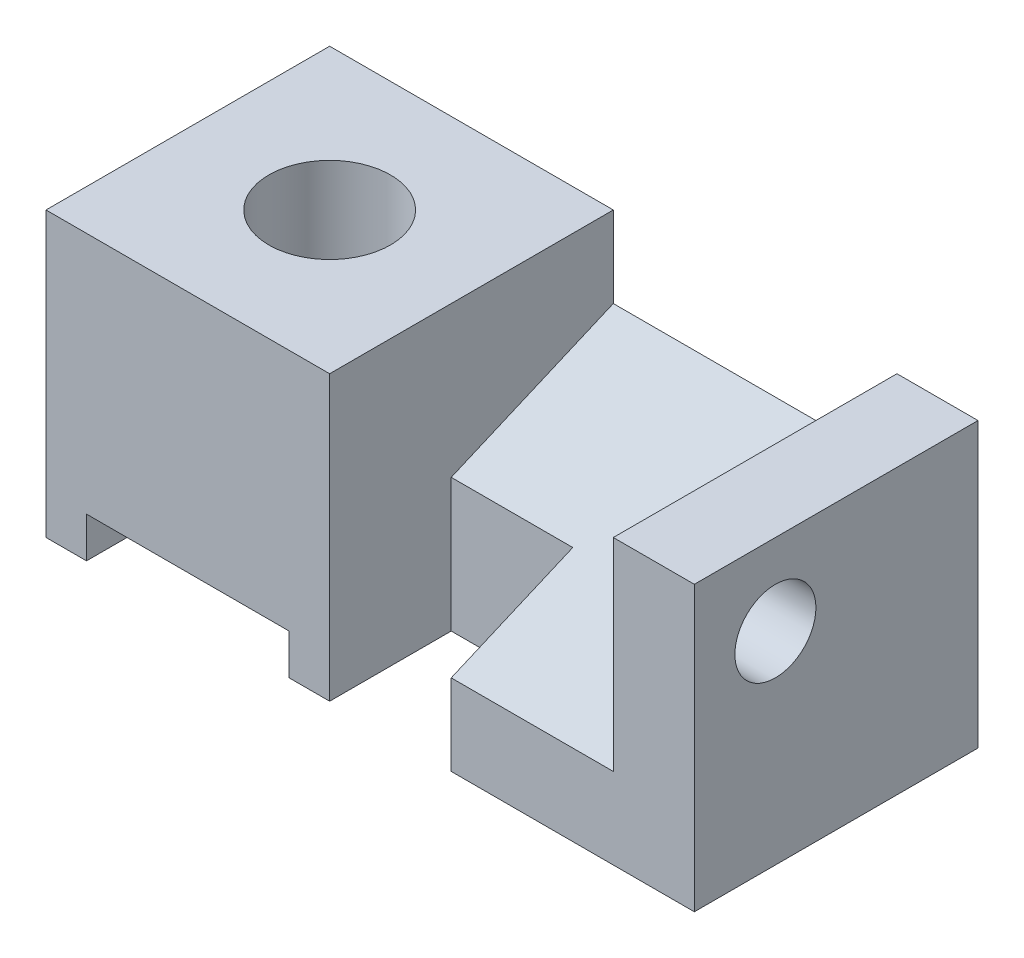
ISO-10303-21;
HEADER;
FILE_DESCRIPTION(('STEP AP214'),'2;1');
FILE_NAME('part.step','',(''),(''),'','','');
FILE_SCHEMA(('AUTOMOTIVE_DESIGN { 1 0 10303 214 1 1 1 1 }'));
ENDSEC;
DATA;
#1=APPLICATION_CONTEXT('core data for automotive mechanical design processes');
#2=APPLICATION_PROTOCOL_DEFINITION('international standard','automotive_design',2000,#1);
#3=PRODUCT_CONTEXT('',#1,'mechanical');
#4=PRODUCT('Part','Part','',(#3));
#5=PRODUCT_RELATED_PRODUCT_CATEGORY('part','',(#4));
#6=PRODUCT_DEFINITION_FORMATION('','',#4);
#7=PRODUCT_DEFINITION_CONTEXT('part definition',#1,'design');
#8=PRODUCT_DEFINITION('design','',#6,#7);
#9=PRODUCT_DEFINITION_SHAPE('','',#8);
#10=(LENGTH_UNIT() NAMED_UNIT(*) SI_UNIT(.MILLI.,.METRE.));
#11=(NAMED_UNIT(*) PLANE_ANGLE_UNIT() SI_UNIT($,.RADIAN.));
#12=(NAMED_UNIT(*) SI_UNIT($,.STERADIAN.) SOLID_ANGLE_UNIT());
#13=UNCERTAINTY_MEASURE_WITH_UNIT(LENGTH_MEASURE(1.E-05),#10,'distance_accuracy_value','');
#14=(GEOMETRIC_REPRESENTATION_CONTEXT(3) GLOBAL_UNCERTAINTY_ASSIGNED_CONTEXT((#13)) GLOBAL_UNIT_ASSIGNED_CONTEXT((#10,
#11,#12)) REPRESENTATION_CONTEXT('',''));
#15=CARTESIAN_POINT('',(0.,0.,0.));
#16=DIRECTION('',(0.,0.,1.));
#17=DIRECTION('',(1.,0.,0.));
#18=AXIS2_PLACEMENT_3D('',#15,#16,#17);
#19=CARTESIAN_POINT('',(0.,0.,0.));
#20=DIRECTION('',(0.,-1.,0.));
#21=DIRECTION('',(0.,0.,-1.));
#22=AXIS2_PLACEMENT_3D('',#19,#20,#21);
#23=PLANE('',#22);
#24=DIRECTION('',(0.,0.,1.));
#25=VECTOR('',#24,1.);
#26=CARTESIAN_POINT('',(5.,0.,-35.));
#27=LINE('',#26,#25);
#28=CARTESIAN_POINT('',(5.,0.,-35.));
#29=VERTEX_POINT('',#28);
#30=CARTESIAN_POINT('',(5.,0.,0.));
#31=VERTEX_POINT('',#30);
#32=EDGE_CURVE('E147',#29,#31,#27,.T.);
#33=ORIENTED_EDGE('',*,*,#32,.T.);
#34=DIRECTION('',(1.,0.,0.));
#35=VECTOR('',#34,1.);
#36=CARTESIAN_POINT('',(0.,0.,0.));
#37=LINE('',#36,#35);
#38=CARTESIAN_POINT('',(0.,0.,0.));
#39=VERTEX_POINT('',#38);
#40=EDGE_CURVE('E182',#39,#31,#37,.T.);
#41=ORIENTED_EDGE('',*,*,#40,.F.);
#42=DIRECTION('',(0.,0.,1.));
#43=VECTOR('',#42,1.);
#44=CARTESIAN_POINT('',(0.,0.,0.));
#45=LINE('',#44,#43);
#46=CARTESIAN_POINT('',(0.,0.,-35.));
#47=VERTEX_POINT('',#46);
#48=EDGE_CURVE('E172',#47,#39,#45,.T.);
#49=ORIENTED_EDGE('',*,*,#48,.F.);
#50=DIRECTION('',(-1.,0.,0.));
#51=VECTOR('',#50,1.);
#52=CARTESIAN_POINT('',(0.,0.,-35.));
#53=LINE('',#52,#51);
#54=EDGE_CURVE('E164',#29,#47,#53,.T.);
#55=ORIENTED_EDGE('',*,*,#54,.F.);
#56=EDGE_LOOP('',(#33,#41,#49,#55));
#57=FACE_BOUND('',#56,.T.);
#58=ADVANCED_FACE('F39',(#57),#23,.T.);
#59=CARTESIAN_POINT('',(0.,35.,0.));
#60=DIRECTION('',(0.,0.,-1.));
#61=DIRECTION('',(-1.,0.,0.));
#62=AXIS2_PLACEMENT_3D('',#59,#60,#61);
#63=PLANE('',#62);
#64=ORIENTED_EDGE('',*,*,#40,.T.);
#65=DIRECTION('',(0.,-1.,0.));
#66=VECTOR('',#65,1.);
#67=CARTESIAN_POINT('',(5.,0.,0.));
#68=LINE('',#67,#66);
#69=CARTESIAN_POINT('',(5.,5.,0.));
#70=VERTEX_POINT('',#69);
#71=EDGE_CURVE('E153',#70,#31,#68,.T.);
#72=ORIENTED_EDGE('',*,*,#71,.F.);
#73=DIRECTION('',(-1.,0.,0.));
#74=VECTOR('',#73,1.);
#75=CARTESIAN_POINT('',(5.,5.,0.));
#76=LINE('',#75,#74);
#77=CARTESIAN_POINT('',(30.,5.,0.));
#78=VERTEX_POINT('',#77);
#79=EDGE_CURVE('E168',#78,#70,#76,.T.);
#80=ORIENTED_EDGE('',*,*,#79,.F.);
#81=DIRECTION('',(0.,1.,0.));
#82=VECTOR('',#81,1.);
#83=CARTESIAN_POINT('',(30.,0.,0.));
#84=LINE('',#83,#82);
#85=CARTESIAN_POINT('',(30.,0.,0.));
#86=VERTEX_POINT('',#85);
#87=EDGE_CURVE('E330',#86,#78,#84,.T.);
#88=ORIENTED_EDGE('',*,*,#87,.F.);
#89=CARTESIAN_POINT('',(35.,0.,0.));
#90=VERTEX_POINT('',#89);
#91=EDGE_CURVE('E231',#86,#90,#37,.T.);
#92=ORIENTED_EDGE('',*,*,#91,.T.);
#93=DIRECTION('',(0.,-1.,0.));
#94=VECTOR('',#93,1.);
#95=CARTESIAN_POINT('',(35.,10.,0.));
#96=LINE('',#95,#94);
#97=CARTESIAN_POINT('',(35.,35.,0.));
#98=VERTEX_POINT('',#97);
#99=EDGE_CURVE('E269',#98,#90,#96,.T.);
#100=ORIENTED_EDGE('',*,*,#99,.F.);
#101=DIRECTION('',(1.,0.,0.));
#102=VECTOR('',#101,1.);
#103=CARTESIAN_POINT('',(0.,35.,0.));
#104=LINE('',#103,#102);
#105=CARTESIAN_POINT('',(0.,35.,0.));
#106=VERTEX_POINT('',#105);
#107=EDGE_CURVE('E243',#106,#98,#104,.T.);
#108=ORIENTED_EDGE('',*,*,#107,.F.);
#109=DIRECTION('',(0.,-1.,0.));
#110=VECTOR('',#109,1.);
#111=CARTESIAN_POINT('',(0.,35.,0.));
#112=LINE('',#111,#110);
#113=EDGE_CURVE('E197',#106,#39,#112,.T.);
#114=ORIENTED_EDGE('',*,*,#113,.T.);
#115=EDGE_LOOP('',(#64,#72,#80,#88,#92,#100,#108,#114));
#116=FACE_BOUND('',#115,.T.);
#117=ADVANCED_FACE('F238',(#116),#63,.F.);
#118=CARTESIAN_POINT('',(35.,25.,-35.));
#119=DIRECTION('',(0.,-0.919145030018058,-0.393919298579168));
#120=DIRECTION('',(0.,0.393919298579168,-0.919145030018058));
#121=AXIS2_PLACEMENT_3D('',#118,#119,#120);
#122=PLANE('',#121);
#123=DIRECTION('',(1.,0.,0.));
#124=VECTOR('',#123,1.);
#125=CARTESIAN_POINT('',(35.,16.4285714285714,-15.));
#126=LINE('',#125,#124);
#127=CARTESIAN_POINT('',(35.,16.4285714285714,-15.));
#128=VERTEX_POINT('',#127);
#129=CARTESIAN_POINT('',(50.,16.4285714285714,-15.));
#130=VERTEX_POINT('',#129);
#131=EDGE_CURVE('E301',#128,#130,#126,.T.);
#132=ORIENTED_EDGE('',*,*,#131,.T.);
#133=DIRECTION('',(0.,-0.393919298579168,0.919145030018058));
#134=VECTOR('',#133,1.);
#135=CARTESIAN_POINT('',(50.,25.,-35.));
#136=LINE('',#135,#134);
#137=CARTESIAN_POINT('',(50.,10.,0.));
#138=VERTEX_POINT('',#137);
#139=EDGE_CURVE('E290',#130,#138,#136,.T.);
#140=ORIENTED_EDGE('',*,*,#139,.T.);
#141=DIRECTION('',(1.,0.,0.));
#142=VECTOR('',#141,1.);
#143=CARTESIAN_POINT('',(35.,10.,0.));
#144=LINE('',#143,#142);
#145=CARTESIAN_POINT('',(70.,10.,0.));
#146=VERTEX_POINT('',#145);
#147=EDGE_CURVE('E223',#138,#146,#144,.T.);
#148=ORIENTED_EDGE('',*,*,#147,.T.);
#149=DIRECTION('',(0.,-0.393919298579168,0.919145030018058));
#150=VECTOR('',#149,1.);
#151=CARTESIAN_POINT('',(70.,25.,-35.));
#152=LINE('',#151,#150);
#153=CARTESIAN_POINT('',(70.,25.,-35.));
#154=VERTEX_POINT('',#153);
#155=EDGE_CURVE('E201',#154,#146,#152,.T.);
#156=ORIENTED_EDGE('',*,*,#155,.F.);
#157=DIRECTION('',(1.,0.,0.));
#158=VECTOR('',#157,1.);
#159=CARTESIAN_POINT('',(35.,25.,-35.));
#160=LINE('',#159,#158);
#161=CARTESIAN_POINT('',(35.,25.,-35.));
#162=VERTEX_POINT('',#161);
#163=EDGE_CURVE('E234',#162,#154,#160,.T.);
#164=ORIENTED_EDGE('',*,*,#163,.F.);
#165=DIRECTION('',(0.,0.393919298579168,-0.919145030018058));
#166=VECTOR('',#165,1.);
#167=CARTESIAN_POINT('',(35.,25.,-35.));
#168=LINE('',#167,#166);
#169=EDGE_CURVE('E266',#128,#162,#168,.T.);
#170=ORIENTED_EDGE('',*,*,#169,.F.);
#171=EDGE_LOOP('',(#132,#140,#148,#156,#164,#170));
#172=FACE_BOUND('',#171,.T.);
#173=ADVANCED_FACE('F366',(#172),#122,.F.);
#174=CARTESIAN_POINT('',(0.,35.,0.));
#175=DIRECTION('',(1.,0.,0.));
#176=DIRECTION('',(0.,0.,-1.));
#177=AXIS2_PLACEMENT_3D('',#174,#175,#176);
#178=PLANE('',#177);
#179=ORIENTED_EDGE('',*,*,#48,.T.);
#180=ORIENTED_EDGE('',*,*,#113,.F.);
#181=DIRECTION('',(0.,0.,1.));
#182=VECTOR('',#181,1.);
#183=CARTESIAN_POINT('',(0.,35.,0.));
#184=LINE('',#183,#182);
#185=CARTESIAN_POINT('',(0.,35.,-35.));
#186=VERTEX_POINT('',#185);
#187=EDGE_CURVE('E180',#186,#106,#184,.T.);
#188=ORIENTED_EDGE('',*,*,#187,.F.);
#189=DIRECTION('',(0.,-1.,0.));
#190=VECTOR('',#189,1.);
#191=CARTESIAN_POINT('',(0.,35.,-35.));
#192=LINE('',#191,#190);
#193=EDGE_CURVE('E186',#186,#47,#192,.T.);
#194=ORIENTED_EDGE('',*,*,#193,.T.);
#195=EDGE_LOOP('',(#179,#180,#188,#194));
#196=FACE_BOUND('',#195,.T.);
#197=ADVANCED_FACE('F41',(#196),#178,.F.);
#198=ORIENTED_EDGE('',*,*,#147,.F.);
#199=DIRECTION('',(0.,-1.,0.));
#200=VECTOR('',#199,1.);
#201=CARTESIAN_POINT('',(50.,35.,0.));
#202=LINE('',#201,#200);
#203=CARTESIAN_POINT('',(50.,0.,0.));
#204=VERTEX_POINT('',#203);
#205=EDGE_CURVE('E211',#138,#204,#202,.T.);
#206=ORIENTED_EDGE('',*,*,#205,.T.);
#207=CARTESIAN_POINT('',(80.,0.,0.));
#208=VERTEX_POINT('',#207);
#209=EDGE_CURVE('E221',#204,#208,#37,.T.);
#210=ORIENTED_EDGE('',*,*,#209,.T.);
#211=DIRECTION('',(0.,-1.,0.));
#212=VECTOR('',#211,1.);
#213=CARTESIAN_POINT('',(80.,35.,0.));
#214=LINE('',#213,#212);
#215=CARTESIAN_POINT('',(80.,35.,0.));
#216=VERTEX_POINT('',#215);
#217=EDGE_CURVE('E193',#216,#208,#214,.T.);
#218=ORIENTED_EDGE('',*,*,#217,.F.);
#219=DIRECTION('',(1.,0.,0.));
#220=VECTOR('',#219,1.);
#221=CARTESIAN_POINT('',(70.,35.,0.));
#222=LINE('',#221,#220);
#223=CARTESIAN_POINT('',(70.,35.,0.));
#224=VERTEX_POINT('',#223);
#225=EDGE_CURVE('E276',#224,#216,#222,.T.);
#226=ORIENTED_EDGE('',*,*,#225,.F.);
#227=DIRECTION('',(0.,-1.,0.));
#228=VECTOR('',#227,1.);
#229=CARTESIAN_POINT('',(70.,0.,0.));
#230=LINE('',#229,#228);
#231=EDGE_CURVE('E281',#224,#146,#230,.T.);
#232=ORIENTED_EDGE('',*,*,#231,.T.);
#233=EDGE_LOOP('',(#198,#206,#210,#218,#226,#232));
#234=FACE_BOUND('',#233,.T.);
#235=ADVANCED_FACE('F220',(#234),#63,.F.);
#236=CARTESIAN_POINT('',(80.,35.,0.));
#237=DIRECTION('',(-1.,0.,0.));
#238=DIRECTION('',(0.,0.,1.));
#239=AXIS2_PLACEMENT_3D('',#236,#237,#238);
#240=PLANE('',#239);
#241=CARTESIAN_POINT('',(80.,25.,-10.));
#242=DIRECTION('',(1.,0.,0.));
#243=DIRECTION('',(0.,0.,-1.));
#244=AXIS2_PLACEMENT_3D('',#241,#242,#243);
#245=CIRCLE('',#244,5.);
#246=CARTESIAN_POINT('',(80.,25.,-15.));
#247=VERTEX_POINT('',#246);
#248=EDGE_CURVE('E312',#247,#247,#245,.T.);
#249=ORIENTED_EDGE('',*,*,#248,.F.);
#250=EDGE_LOOP('',(#249));
#251=FACE_BOUND('',#250,.T.);
#252=DIRECTION('',(0.,-1.,0.));
#253=VECTOR('',#252,1.);
#254=CARTESIAN_POINT('',(80.,35.,-35.));
#255=LINE('',#254,#253);
#256=CARTESIAN_POINT('',(80.,35.,-35.));
#257=VERTEX_POINT('',#256);
#258=CARTESIAN_POINT('',(80.,0.,-35.));
#259=VERTEX_POINT('',#258);
#260=EDGE_CURVE('E189',#257,#259,#255,.T.);
#261=ORIENTED_EDGE('',*,*,#260,.F.);
#262=DIRECTION('',(0.,0.,1.));
#263=VECTOR('',#262,1.);
#264=CARTESIAN_POINT('',(80.,35.,-35.));
#265=LINE('',#264,#263);
#266=EDGE_CURVE('E285',#257,#216,#265,.T.);
#267=ORIENTED_EDGE('',*,*,#266,.T.);
#268=ORIENTED_EDGE('',*,*,#217,.T.);
#269=DIRECTION('',(0.,0.,-1.));
#270=VECTOR('',#269,1.);
#271=CARTESIAN_POINT('',(80.,0.,0.));
#272=LINE('',#271,#270);
#273=EDGE_CURVE('E175',#208,#259,#272,.T.);
#274=ORIENTED_EDGE('',*,*,#273,.T.);
#275=EDGE_LOOP('',(#261,#267,#268,#274));
#276=FACE_BOUND('',#275,.T.);
#277=ADVANCED_FACE('F383',(#251,#276),#240,.F.);
#278=CARTESIAN_POINT('',(0.,35.,-35.));
#279=DIRECTION('',(0.,0.,1.));
#280=DIRECTION('',(1.,0.,0.));
#281=AXIS2_PLACEMENT_3D('',#278,#279,#280);
#282=PLANE('',#281);
#283=DIRECTION('',(-1.,0.,0.));
#284=VECTOR('',#283,1.);
#285=CARTESIAN_POINT('',(5.,5.,-35.));
#286=LINE('',#285,#284);
#287=CARTESIAN_POINT('',(30.,5.,-35.));
#288=VERTEX_POINT('',#287);
#289=CARTESIAN_POINT('',(5.,5.,-35.));
#290=VERTEX_POINT('',#289);
#291=EDGE_CURVE('E159',#288,#290,#286,.T.);
#292=ORIENTED_EDGE('',*,*,#291,.T.);
#293=DIRECTION('',(0.,-1.,0.));
#294=VECTOR('',#293,1.);
#295=CARTESIAN_POINT('',(5.,0.,-35.));
#296=LINE('',#295,#294);
#297=EDGE_CURVE('E150',#290,#29,#296,.T.);
#298=ORIENTED_EDGE('',*,*,#297,.T.);
#299=ORIENTED_EDGE('',*,*,#54,.T.);
#300=ORIENTED_EDGE('',*,*,#193,.F.);
#301=DIRECTION('',(-1.,0.,0.));
#302=VECTOR('',#301,1.);
#303=CARTESIAN_POINT('',(0.,35.,-35.));
#304=LINE('',#303,#302);
#305=CARTESIAN_POINT('',(35.,35.,-35.));
#306=VERTEX_POINT('',#305);
#307=EDGE_CURVE('E190',#306,#186,#304,.T.);
#308=ORIENTED_EDGE('',*,*,#307,.F.);
#309=DIRECTION('',(0.,1.,0.));
#310=VECTOR('',#309,1.);
#311=CARTESIAN_POINT('',(35.,35.,-35.));
#312=LINE('',#311,#310);
#313=EDGE_CURVE('E250',#162,#306,#312,.T.);
#314=ORIENTED_EDGE('',*,*,#313,.F.);
#315=ORIENTED_EDGE('',*,*,#163,.T.);
#316=DIRECTION('',(0.,1.,0.));
#317=VECTOR('',#316,1.);
#318=CARTESIAN_POINT('',(70.,0.,-35.));
#319=LINE('',#318,#317);
#320=CARTESIAN_POINT('',(70.,35.,-35.));
#321=VERTEX_POINT('',#320);
#322=EDGE_CURVE('E289',#154,#321,#319,.T.);
#323=ORIENTED_EDGE('',*,*,#322,.T.);
#324=DIRECTION('',(1.,0.,0.));
#325=VECTOR('',#324,1.);
#326=CARTESIAN_POINT('',(70.,35.,-35.));
#327=LINE('',#326,#325);
#328=EDGE_CURVE('E277',#321,#257,#327,.T.);
#329=ORIENTED_EDGE('',*,*,#328,.T.);
#330=ORIENTED_EDGE('',*,*,#260,.T.);
#331=CARTESIAN_POINT('',(30.,0.,-35.));
#332=VERTEX_POINT('',#331);
#333=EDGE_CURVE('E174',#259,#332,#53,.T.);
#334=ORIENTED_EDGE('',*,*,#333,.T.);
#335=DIRECTION('',(0.,1.,0.));
#336=VECTOR('',#335,1.);
#337=CARTESIAN_POINT('',(30.,0.,-35.));
#338=LINE('',#337,#336);
#339=EDGE_CURVE('E56',#332,#288,#338,.T.);
#340=ORIENTED_EDGE('',*,*,#339,.T.);
#341=EDGE_LOOP('',(#292,#298,#299,#300,#308,#314,#315,#323,#329,#330,#334,#340));
#342=FACE_BOUND('',#341,.T.);
#343=ADVANCED_FACE('F162',(#342),#282,.F.);
#344=CARTESIAN_POINT('',(0.,35.,0.));
#345=DIRECTION('',(0.,-1.,0.));
#346=DIRECTION('',(0.,0.,-1.));
#347=AXIS2_PLACEMENT_3D('',#344,#345,#346);
#348=PLANE('',#347);
#349=CARTESIAN_POINT('',(17.5,35.,-17.5));
#350=DIRECTION('',(0.,1.,0.));
#351=DIRECTION('',(0.,0.,1.));
#352=AXIS2_PLACEMENT_3D('',#349,#350,#351);
#353=CIRCLE('',#352,7.5);
#354=CARTESIAN_POINT('',(17.5,35.,-10.));
#355=VERTEX_POINT('',#354);
#356=EDGE_CURVE('E340',#355,#355,#353,.T.);
#357=ORIENTED_EDGE('',*,*,#356,.F.);
#358=EDGE_LOOP('',(#357));
#359=FACE_BOUND('',#358,.T.);
#360=ORIENTED_EDGE('',*,*,#107,.T.);
#361=DIRECTION('',(0.,0.,1.));
#362=VECTOR('',#361,1.);
#363=CARTESIAN_POINT('',(35.,35.,0.));
#364=LINE('',#363,#362);
#365=EDGE_CURVE('E273',#306,#98,#364,.T.);
#366=ORIENTED_EDGE('',*,*,#365,.F.);
#367=ORIENTED_EDGE('',*,*,#307,.T.);
#368=ORIENTED_EDGE('',*,*,#187,.T.);
#369=EDGE_LOOP('',(#360,#366,#367,#368));
#370=FACE_BOUND('',#369,.T.);
#371=ADVANCED_FACE('F371',(#359,#370),#348,.F.);
#372=DIRECTION('',(0.,0.,1.));
#373=VECTOR('',#372,1.);
#374=CARTESIAN_POINT('',(30.,0.,-35.));
#375=LINE('',#374,#373);
#376=EDGE_CURVE('E158',#332,#86,#375,.T.);
#377=ORIENTED_EDGE('',*,*,#376,.F.);
#378=ORIENTED_EDGE('',*,*,#333,.F.);
#379=ORIENTED_EDGE('',*,*,#273,.F.);
#380=ORIENTED_EDGE('',*,*,#209,.F.);
#381=DIRECTION('',(0.,0.,1.));
#382=VECTOR('',#381,1.);
#383=CARTESIAN_POINT('',(50.,0.,0.));
#384=LINE('',#383,#382);
#385=CARTESIAN_POINT('',(50.,0.,-15.));
#386=VERTEX_POINT('',#385);
#387=EDGE_CURVE('E49',#386,#204,#384,.T.);
#388=ORIENTED_EDGE('',*,*,#387,.F.);
#389=DIRECTION('',(1.,0.,0.));
#390=VECTOR('',#389,1.);
#391=CARTESIAN_POINT('',(0.,0.,-15.));
#392=LINE('',#391,#390);
#393=CARTESIAN_POINT('',(35.,0.,-15.));
#394=VERTEX_POINT('',#393);
#395=EDGE_CURVE('E225',#394,#386,#392,.T.);
#396=ORIENTED_EDGE('',*,*,#395,.F.);
#397=DIRECTION('',(0.,0.,-1.));
#398=VECTOR('',#397,1.);
#399=CARTESIAN_POINT('',(35.,0.,0.));
#400=LINE('',#399,#398);
#401=EDGE_CURVE('E11',#90,#394,#400,.T.);
#402=ORIENTED_EDGE('',*,*,#401,.F.);
#403=ORIENTED_EDGE('',*,*,#91,.F.);
#404=EDGE_LOOP('',(#377,#378,#379,#380,#388,#396,#402,#403));
#405=FACE_BOUND('',#404,.T.);
#406=ADVANCED_FACE('F228',(#405),#23,.T.);
#407=CARTESIAN_POINT('',(35.,0.,0.));
#408=DIRECTION('',(-1.,0.,0.));
#409=DIRECTION('',(0.,0.,1.));
#410=AXIS2_PLACEMENT_3D('',#407,#408,#409);
#411=PLANE('',#410);
#412=ORIENTED_EDGE('',*,*,#365,.T.);
#413=ORIENTED_EDGE('',*,*,#99,.T.);
#414=ORIENTED_EDGE('',*,*,#401,.T.);
#415=DIRECTION('',(0.,-1.,0.));
#416=VECTOR('',#415,1.);
#417=CARTESIAN_POINT('',(35.,35.,-15.));
#418=LINE('',#417,#416);
#419=EDGE_CURVE('E64',#128,#394,#418,.T.);
#420=ORIENTED_EDGE('',*,*,#419,.F.);
#421=ORIENTED_EDGE('',*,*,#169,.T.);
#422=ORIENTED_EDGE('',*,*,#313,.T.);
#423=EDGE_LOOP('',(#412,#413,#414,#420,#421,#422));
#424=FACE_BOUND('',#423,.T.);
#425=ADVANCED_FACE('F370',(#424),#411,.F.);
#426=CARTESIAN_POINT('',(70.,0.,0.));
#427=DIRECTION('',(1.,0.,0.));
#428=DIRECTION('',(0.,0.,-1.));
#429=AXIS2_PLACEMENT_3D('',#426,#427,#428);
#430=PLANE('',#429);
#431=CARTESIAN_POINT('',(70.,25.,-10.));
#432=DIRECTION('',(1.,0.,0.));
#433=DIRECTION('',(0.,0.,-1.));
#434=AXIS2_PLACEMENT_3D('',#431,#432,#433);
#435=CIRCLE('',#434,5.);
#436=CARTESIAN_POINT('',(70.,25.,-15.));
#437=VERTEX_POINT('',#436);
#438=EDGE_CURVE('E309',#437,#437,#435,.T.);
#439=ORIENTED_EDGE('',*,*,#438,.T.);
#440=EDGE_LOOP('',(#439));
#441=FACE_BOUND('',#440,.T.);
#442=ORIENTED_EDGE('',*,*,#322,.F.);
#443=ORIENTED_EDGE('',*,*,#155,.T.);
#444=ORIENTED_EDGE('',*,*,#231,.F.);
#445=DIRECTION('',(0.,0.,1.));
#446=VECTOR('',#445,1.);
#447=CARTESIAN_POINT('',(70.,35.,-35.));
#448=LINE('',#447,#446);
#449=EDGE_CURVE('E293',#321,#224,#448,.T.);
#450=ORIENTED_EDGE('',*,*,#449,.F.);
#451=EDGE_LOOP('',(#442,#443,#444,#450));
#452=FACE_BOUND('',#451,.T.);
#453=ADVANCED_FACE('F376',(#441,#452),#430,.F.);
#454=CARTESIAN_POINT('',(70.,35.,-35.));
#455=DIRECTION('',(0.,1.,0.));
#456=DIRECTION('',(0.,0.,1.));
#457=AXIS2_PLACEMENT_3D('',#454,#455,#456);
#458=PLANE('',#457);
#459=ORIENTED_EDGE('',*,*,#266,.F.);
#460=ORIENTED_EDGE('',*,*,#328,.F.);
#461=ORIENTED_EDGE('',*,*,#449,.T.);
#462=ORIENTED_EDGE('',*,*,#225,.T.);
#463=EDGE_LOOP('',(#459,#460,#461,#462));
#464=FACE_BOUND('',#463,.T.);
#465=ADVANCED_FACE('F388',(#464),#458,.T.);
#466=CARTESIAN_POINT('',(50.,35.,0.));
#467=DIRECTION('',(1.,0.,0.));
#468=DIRECTION('',(0.,0.,-1.));
#469=AXIS2_PLACEMENT_3D('',#466,#467,#468);
#470=PLANE('',#469);
#471=DIRECTION('',(0.,-1.,0.));
#472=VECTOR('',#471,1.);
#473=CARTESIAN_POINT('',(50.,35.,-15.));
#474=LINE('',#473,#472);
#475=EDGE_CURVE('E214',#130,#386,#474,.T.);
#476=ORIENTED_EDGE('',*,*,#475,.T.);
#477=ORIENTED_EDGE('',*,*,#387,.T.);
#478=ORIENTED_EDGE('',*,*,#205,.F.);
#479=ORIENTED_EDGE('',*,*,#139,.F.);
#480=EDGE_LOOP('',(#476,#477,#478,#479));
#481=FACE_BOUND('',#480,.T.);
#482=ADVANCED_FACE('F210',(#481),#470,.F.);
#483=CARTESIAN_POINT('',(35.,35.,-15.));
#484=DIRECTION('',(0.,0.,-1.));
#485=DIRECTION('',(-1.,0.,0.));
#486=AXIS2_PLACEMENT_3D('',#483,#484,#485);
#487=PLANE('',#486);
#488=ORIENTED_EDGE('',*,*,#419,.T.);
#489=ORIENTED_EDGE('',*,*,#395,.T.);
#490=ORIENTED_EDGE('',*,*,#475,.F.);
#491=ORIENTED_EDGE('',*,*,#131,.F.);
#492=EDGE_LOOP('',(#488,#489,#490,#491));
#493=FACE_BOUND('',#492,.T.);
#494=ADVANCED_FACE('F395',(#493),#487,.F.);
#495=CARTESIAN_POINT('',(70.,25.,-10.));
#496=DIRECTION('',(1.,0.,0.));
#497=DIRECTION('',(0.,0.,-1.));
#498=AXIS2_PLACEMENT_3D('',#495,#496,#497);
#499=CYLINDRICAL_SURFACE('',#498,5.);
#500=ORIENTED_EDGE('',*,*,#438,.F.);
#501=EDGE_LOOP('',(#500));
#502=FACE_BOUND('',#501,.T.);
#503=ORIENTED_EDGE('',*,*,#248,.T.);
#504=EDGE_LOOP('',(#503));
#505=FACE_BOUND('',#504,.T.);
#506=ADVANCED_FACE('F398',(#502,#505),#499,.F.);
#507=CARTESIAN_POINT('',(5.,0.,-35.));
#508=DIRECTION('',(-1.,0.,0.));
#509=DIRECTION('',(0.,0.,1.));
#510=AXIS2_PLACEMENT_3D('',#507,#508,#509);
#511=PLANE('',#510);
#512=ORIENTED_EDGE('',*,*,#71,.T.);
#513=ORIENTED_EDGE('',*,*,#32,.F.);
#514=ORIENTED_EDGE('',*,*,#297,.F.);
#515=DIRECTION('',(0.,0.,1.));
#516=VECTOR('',#515,1.);
#517=CARTESIAN_POINT('',(5.,5.,-35.));
#518=LINE('',#517,#516);
#519=EDGE_CURVE('E316',#290,#70,#518,.T.);
#520=ORIENTED_EDGE('',*,*,#519,.T.);
#521=EDGE_LOOP('',(#512,#513,#514,#520));
#522=FACE_BOUND('',#521,.T.);
#523=ADVANCED_FACE('F149',(#522),#511,.F.);
#524=CARTESIAN_POINT('',(5.,5.,-35.));
#525=DIRECTION('',(0.,1.,0.));
#526=DIRECTION('',(0.,0.,1.));
#527=AXIS2_PLACEMENT_3D('',#524,#525,#526);
#528=PLANE('',#527);
#529=CARTESIAN_POINT('',(17.5,5.,-17.5));
#530=DIRECTION('',(0.,1.,0.));
#531=DIRECTION('',(0.,0.,1.));
#532=AXIS2_PLACEMENT_3D('',#529,#530,#531);
#533=CIRCLE('',#532,7.5);
#534=CARTESIAN_POINT('',(17.5,5.,-10.));
#535=VERTEX_POINT('',#534);
#536=EDGE_CURVE('E43',#535,#535,#533,.T.);
#537=ORIENTED_EDGE('',*,*,#536,.T.);
#538=EDGE_LOOP('',(#537));
#539=FACE_BOUND('',#538,.T.);
#540=ORIENTED_EDGE('',*,*,#79,.T.);
#541=ORIENTED_EDGE('',*,*,#519,.F.);
#542=ORIENTED_EDGE('',*,*,#291,.F.);
#543=DIRECTION('',(0.,0.,1.));
#544=VECTOR('',#543,1.);
#545=CARTESIAN_POINT('',(30.,5.,-35.));
#546=LINE('',#545,#544);
#547=EDGE_CURVE('E322',#288,#78,#546,.T.);
#548=ORIENTED_EDGE('',*,*,#547,.T.);
#549=EDGE_LOOP('',(#540,#541,#542,#548));
#550=FACE_BOUND('',#549,.T.);
#551=ADVANCED_FACE('F349',(#539,#550),#528,.F.);
#552=CARTESIAN_POINT('',(30.,0.,-35.));
#553=DIRECTION('',(1.,0.,0.));
#554=DIRECTION('',(0.,0.,-1.));
#555=AXIS2_PLACEMENT_3D('',#552,#553,#554);
#556=PLANE('',#555);
#557=ORIENTED_EDGE('',*,*,#87,.T.);
#558=ORIENTED_EDGE('',*,*,#547,.F.);
#559=ORIENTED_EDGE('',*,*,#339,.F.);
#560=ORIENTED_EDGE('',*,*,#376,.T.);
#561=EDGE_LOOP('',(#557,#558,#559,#560));
#562=FACE_BOUND('',#561,.T.);
#563=ADVANCED_FACE('F354',(#562),#556,.F.);
#564=CARTESIAN_POINT('',(17.5,0.,-17.5));
#565=DIRECTION('',(0.,1.,0.));
#566=DIRECTION('',(0.,0.,1.));
#567=AXIS2_PLACEMENT_3D('',#564,#565,#566);
#568=CYLINDRICAL_SURFACE('',#567,7.5);
#569=ORIENTED_EDGE('',*,*,#356,.T.);
#570=EDGE_LOOP('',(#569));
#571=FACE_BOUND('',#570,.T.);
#572=ORIENTED_EDGE('',*,*,#536,.F.);
#573=EDGE_LOOP('',(#572));
#574=FACE_BOUND('',#573,.T.);
#575=ADVANCED_FACE('F352',(#571,#574),#568,.F.);
#576=CLOSED_SHELL('',(#58,#117,#173,#197,#235,#277,#343,#371,#406,#425,#453,#465,#482,#494,#506,
#523,#551,#563,#575));
#577=MANIFOLD_SOLID_BREP('B2',#576);
#578=ADVANCED_BREP_SHAPE_REPRESENTATION('',(#18,#577),#14);
#579=SHAPE_DEFINITION_REPRESENTATION(#9,#578);
ENDSEC;
END-ISO-10303-21;
